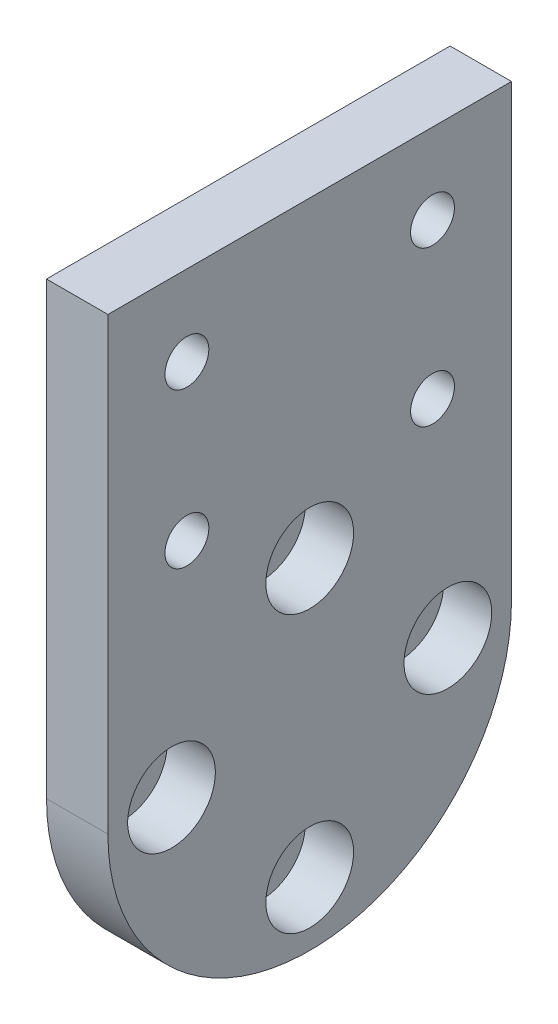
ISO-10303-21;
HEADER;
FILE_DESCRIPTION(('STEP AP214'),'2;1');
FILE_NAME('part.step','',(''),(''),'','','');
FILE_SCHEMA(('AUTOMOTIVE_DESIGN { 1 0 10303 214 1 1 1 1 }'));
ENDSEC;
DATA;
#1=APPLICATION_CONTEXT('core data for automotive mechanical design processes');
#2=APPLICATION_PROTOCOL_DEFINITION('international standard','automotive_design',2000,#1);
#3=PRODUCT_CONTEXT('',#1,'mechanical');
#4=PRODUCT('Part','Part','',(#3));
#5=PRODUCT_RELATED_PRODUCT_CATEGORY('part','',(#4));
#6=PRODUCT_DEFINITION_FORMATION('','',#4);
#7=PRODUCT_DEFINITION_CONTEXT('part definition',#1,'design');
#8=PRODUCT_DEFINITION('design','',#6,#7);
#9=PRODUCT_DEFINITION_SHAPE('','',#8);
#10=(LENGTH_UNIT() NAMED_UNIT(*) SI_UNIT(.MILLI.,.METRE.));
#11=(NAMED_UNIT(*) PLANE_ANGLE_UNIT() SI_UNIT($,.RADIAN.));
#12=(NAMED_UNIT(*) SI_UNIT($,.STERADIAN.) SOLID_ANGLE_UNIT());
#13=UNCERTAINTY_MEASURE_WITH_UNIT(LENGTH_MEASURE(1.E-05),#10,'distance_accuracy_value','');
#14=(GEOMETRIC_REPRESENTATION_CONTEXT(3) GLOBAL_UNCERTAINTY_ASSIGNED_CONTEXT((#13)) GLOBAL_UNIT_ASSIGNED_CONTEXT((#10,
#11,#12)) REPRESENTATION_CONTEXT('',''));
#15=CARTESIAN_POINT('',(0.,0.,0.));
#16=DIRECTION('',(0.,0.,1.));
#17=DIRECTION('',(1.,0.,0.));
#18=AXIS2_PLACEMENT_3D('',#15,#16,#17);
#19=CARTESIAN_POINT('',(-32.,-17.5,23.));
#20=DIRECTION('',(0.,0.,1.));
#21=DIRECTION('',(1.,0.,0.));
#22=AXIS2_PLACEMENT_3D('',#19,#20,#21);
#23=PLANE('',#22);
#24=DIRECTION('',(0.,-1.,0.));
#25=VECTOR('',#24,1.);
#26=CARTESIAN_POINT('',(-25.,-17.5,23.));
#27=LINE('',#26,#25);
#28=CARTESIAN_POINT('',(-25.,5.,23.));
#29=VERTEX_POINT('',#28);
#30=CARTESIAN_POINT('',(-25.,-46.302,23.));
#31=VERTEX_POINT('',#30);
#32=EDGE_CURVE('E118',#29,#31,#27,.T.);
#33=ORIENTED_EDGE('',*,*,#32,.F.);
#34=DIRECTION('',(1.,0.,0.));
#35=VECTOR('',#34,1.);
#36=CARTESIAN_POINT('',(-32.,5.,23.));
#37=LINE('',#36,#35);
#38=CARTESIAN_POINT('',(-32.,5.,23.));
#39=VERTEX_POINT('',#38);
#40=EDGE_CURVE('E11',#39,#29,#37,.T.);
#41=ORIENTED_EDGE('',*,*,#40,.F.);
#42=DIRECTION('',(0.,-1.,0.));
#43=VECTOR('',#42,1.);
#44=CARTESIAN_POINT('',(-32.,-17.5,23.));
#45=LINE('',#44,#43);
#46=CARTESIAN_POINT('',(-32.,-46.302,23.));
#47=VERTEX_POINT('',#46);
#48=EDGE_CURVE('E81',#39,#47,#45,.T.);
#49=ORIENTED_EDGE('',*,*,#48,.T.);
#50=DIRECTION('',(1.,0.,0.));
#51=VECTOR('',#50,1.);
#52=CARTESIAN_POINT('',(-32.,-46.302,23.));
#53=LINE('',#52,#51);
#54=EDGE_CURVE('E59',#47,#31,#53,.T.);
#55=ORIENTED_EDGE('',*,*,#54,.T.);
#56=EDGE_LOOP('',(#33,#41,#49,#55));
#57=FACE_BOUND('',#56,.T.);
#58=ADVANCED_FACE('F17',(#57),#23,.T.);
#59=CARTESIAN_POINT('',(-32.,5.,0.));
#60=DIRECTION('',(0.,-1.,0.));
#61=DIRECTION('',(0.,0.,-1.));
#62=AXIS2_PLACEMENT_3D('',#59,#60,#61);
#63=PLANE('',#62);
#64=DIRECTION('',(0.,0.,-1.));
#65=VECTOR('',#64,1.);
#66=CARTESIAN_POINT('',(-25.,5.,0.));
#67=LINE('',#66,#65);
#68=CARTESIAN_POINT('',(-25.,5.,-23.));
#69=VERTEX_POINT('',#68);
#70=EDGE_CURVE('E87',#29,#69,#67,.T.);
#71=ORIENTED_EDGE('',*,*,#70,.T.);
#72=DIRECTION('',(1.,0.,0.));
#73=VECTOR('',#72,1.);
#74=CARTESIAN_POINT('',(-32.,5.,-23.));
#75=LINE('',#74,#73);
#76=CARTESIAN_POINT('',(-32.,5.,-23.));
#77=VERTEX_POINT('',#76);
#78=EDGE_CURVE('E26',#77,#69,#75,.T.);
#79=ORIENTED_EDGE('',*,*,#78,.F.);
#80=DIRECTION('',(0.,0.,-1.));
#81=VECTOR('',#80,1.);
#82=CARTESIAN_POINT('',(-32.,5.,0.));
#83=LINE('',#82,#81);
#84=EDGE_CURVE('E77',#39,#77,#83,.T.);
#85=ORIENTED_EDGE('',*,*,#84,.F.);
#86=ORIENTED_EDGE('',*,*,#40,.T.);
#87=EDGE_LOOP('',(#71,#79,#85,#86));
#88=FACE_BOUND('',#87,.T.);
#89=ADVANCED_FACE('F85',(#88),#63,.F.);
#90=CARTESIAN_POINT('',(-32.,-20.651,-23.));
#91=DIRECTION('',(0.,0.,1.));
#92=DIRECTION('',(1.,0.,0.));
#93=AXIS2_PLACEMENT_3D('',#90,#91,#92);
#94=PLANE('',#93);
#95=DIRECTION('',(0.,-1.,0.));
#96=VECTOR('',#95,1.);
#97=CARTESIAN_POINT('',(-25.,-20.651,-23.));
#98=LINE('',#97,#96);
#99=CARTESIAN_POINT('',(-25.,-46.302,-23.));
#100=VERTEX_POINT('',#99);
#101=EDGE_CURVE('E68',#69,#100,#98,.T.);
#102=ORIENTED_EDGE('',*,*,#101,.T.);
#103=DIRECTION('',(1.,0.,0.));
#104=VECTOR('',#103,1.);
#105=CARTESIAN_POINT('',(-32.,-46.302,-23.));
#106=LINE('',#105,#104);
#107=CARTESIAN_POINT('',(-32.,-46.302,-23.));
#108=VERTEX_POINT('',#107);
#109=EDGE_CURVE('E89',#108,#100,#106,.T.);
#110=ORIENTED_EDGE('',*,*,#109,.F.);
#111=DIRECTION('',(0.,-1.,0.));
#112=VECTOR('',#111,1.);
#113=CARTESIAN_POINT('',(-32.,-20.651,-23.));
#114=LINE('',#113,#112);
#115=EDGE_CURVE('E39',#77,#108,#114,.T.);
#116=ORIENTED_EDGE('',*,*,#115,.F.);
#117=ORIENTED_EDGE('',*,*,#78,.T.);
#118=EDGE_LOOP('',(#102,#110,#116,#117));
#119=FACE_BOUND('',#118,.T.);
#120=ADVANCED_FACE('F90',(#119),#94,.F.);
#121=CARTESIAN_POINT('',(-32.,-4.17737907709263,-14.));
#122=DIRECTION('',(1.,0.,0.));
#123=DIRECTION('',(0.,0.,-1.));
#124=AXIS2_PLACEMENT_3D('',#121,#122,#123);
#125=CYLINDRICAL_SURFACE('',#124,2.5);
#126=CARTESIAN_POINT('',(-32.,-4.17737907709263,-14.));
#127=DIRECTION('',(-1.,0.,0.));
#128=DIRECTION('',(0.,0.,1.));
#129=AXIS2_PLACEMENT_3D('',#126,#127,#128);
#130=CIRCLE('',#129,2.5);
#131=CARTESIAN_POINT('',(-32.,-4.17737907709263,-11.5));
#132=VERTEX_POINT('',#131);
#133=EDGE_CURVE('E110',#132,#132,#130,.T.);
#134=ORIENTED_EDGE('',*,*,#133,.T.);
#135=EDGE_LOOP('',(#134));
#136=FACE_BOUND('',#135,.T.);
#137=CARTESIAN_POINT('',(-25.,-4.17737907709263,-14.));
#138=DIRECTION('',(-1.,0.,0.));
#139=DIRECTION('',(0.,0.,1.));
#140=AXIS2_PLACEMENT_3D('',#137,#138,#139);
#141=CIRCLE('',#140,2.5);
#142=CARTESIAN_POINT('',(-25.,-4.17737907709263,-11.5));
#143=VERTEX_POINT('',#142);
#144=EDGE_CURVE('E136',#143,#143,#141,.T.);
#145=ORIENTED_EDGE('',*,*,#144,.F.);
#146=EDGE_LOOP('',(#145));
#147=FACE_BOUND('',#146,.T.);
#148=ADVANCED_FACE('F279',(#136,#147),#125,.F.);
#149=CARTESIAN_POINT('',(-32.,-4.17737907709263,14.));
#150=DIRECTION('',(1.,0.,0.));
#151=DIRECTION('',(0.,0.,-1.));
#152=AXIS2_PLACEMENT_3D('',#149,#150,#151);
#153=CYLINDRICAL_SURFACE('',#152,2.5);
#154=CARTESIAN_POINT('',(-32.,-4.17737907709263,14.));
#155=DIRECTION('',(1.,0.,0.));
#156=DIRECTION('',(0.,0.,1.));
#157=AXIS2_PLACEMENT_3D('',#154,#155,#156);
#158=CIRCLE('',#157,2.5);
#159=CARTESIAN_POINT('',(-32.,-4.17737907709263,16.5));
#160=VERTEX_POINT('',#159);
#161=EDGE_CURVE('E106',#160,#160,#158,.T.);
#162=ORIENTED_EDGE('',*,*,#161,.F.);
#163=EDGE_LOOP('',(#162));
#164=FACE_BOUND('',#163,.T.);
#165=CARTESIAN_POINT('',(-25.,-4.17737907709263,14.));
#166=DIRECTION('',(1.,0.,0.));
#167=DIRECTION('',(0.,0.,1.));
#168=AXIS2_PLACEMENT_3D('',#165,#166,#167);
#169=CIRCLE('',#168,2.5);
#170=CARTESIAN_POINT('',(-25.,-4.17737907709263,16.5));
#171=VERTEX_POINT('',#170);
#172=EDGE_CURVE('E132',#171,#171,#169,.T.);
#173=ORIENTED_EDGE('',*,*,#172,.T.);
#174=EDGE_LOOP('',(#173));
#175=FACE_BOUND('',#174,.T.);
#176=ADVANCED_FACE('F284',(#164,#175),#153,.F.);
#177=CARTESIAN_POINT('',(-32.,-21.8226209229073,14.));
#178=DIRECTION('',(1.,0.,0.));
#179=DIRECTION('',(0.,0.,-1.));
#180=AXIS2_PLACEMENT_3D('',#177,#178,#179);
#181=CYLINDRICAL_SURFACE('',#180,2.5);
#182=CARTESIAN_POINT('',(-32.,-21.8226209229073,14.));
#183=DIRECTION('',(-1.,0.,0.));
#184=DIRECTION('',(0.,0.,1.));
#185=AXIS2_PLACEMENT_3D('',#182,#183,#184);
#186=CIRCLE('',#185,2.5);
#187=CARTESIAN_POINT('',(-32.,-21.8226209229073,16.5));
#188=VERTEX_POINT('',#187);
#189=EDGE_CURVE('E99',#188,#188,#186,.T.);
#190=ORIENTED_EDGE('',*,*,#189,.T.);
#191=EDGE_LOOP('',(#190));
#192=FACE_BOUND('',#191,.T.);
#193=CARTESIAN_POINT('',(-25.,-21.8226209229073,14.));
#194=DIRECTION('',(-1.,0.,0.));
#195=DIRECTION('',(0.,0.,1.));
#196=AXIS2_PLACEMENT_3D('',#193,#194,#195);
#197=CIRCLE('',#196,2.5);
#198=CARTESIAN_POINT('',(-25.,-21.8226209229073,16.5));
#199=VERTEX_POINT('',#198);
#200=EDGE_CURVE('E128',#199,#199,#197,.T.);
#201=ORIENTED_EDGE('',*,*,#200,.F.);
#202=EDGE_LOOP('',(#201));
#203=FACE_BOUND('',#202,.T.);
#204=ADVANCED_FACE('F267',(#192,#203),#181,.F.);
#205=CARTESIAN_POINT('',(-32.,-46.302,0.));
#206=DIRECTION('',(1.,0.,0.));
#207=DIRECTION('',(0.,0.,-1.));
#208=AXIS2_PLACEMENT_3D('',#205,#206,#207);
#209=CYLINDRICAL_SURFACE('',#208,23.);
#210=CARTESIAN_POINT('',(-25.,-46.302,0.));
#211=DIRECTION('',(-1.,0.,0.));
#212=DIRECTION('',(0.,0.,1.));
#213=AXIS2_PLACEMENT_3D('',#210,#211,#212);
#214=CIRCLE('',#213,23.);
#215=EDGE_CURVE('E125',#100,#31,#214,.T.);
#216=ORIENTED_EDGE('',*,*,#215,.T.);
#217=ORIENTED_EDGE('',*,*,#54,.F.);
#218=CARTESIAN_POINT('',(-32.,-46.302,0.));
#219=DIRECTION('',(-1.,0.,0.));
#220=DIRECTION('',(0.,0.,1.));
#221=AXIS2_PLACEMENT_3D('',#218,#219,#220);
#222=CIRCLE('',#221,23.);
#223=EDGE_CURVE('E93',#108,#47,#222,.T.);
#224=ORIENTED_EDGE('',*,*,#223,.F.);
#225=ORIENTED_EDGE('',*,*,#109,.T.);
#226=EDGE_LOOP('',(#216,#217,#224,#225));
#227=FACE_BOUND('',#226,.T.);
#228=ADVANCED_FACE('F257',(#227),#209,.T.);
#229=CARTESIAN_POINT('',(-32.,-21.8226209229073,-14.));
#230=DIRECTION('',(1.,0.,0.));
#231=DIRECTION('',(0.,0.,-1.));
#232=AXIS2_PLACEMENT_3D('',#229,#230,#231);
#233=CYLINDRICAL_SURFACE('',#232,2.5);
#234=CARTESIAN_POINT('',(-32.,-21.8226209229073,-14.));
#235=DIRECTION('',(1.,0.,0.));
#236=DIRECTION('',(0.,0.,1.));
#237=AXIS2_PLACEMENT_3D('',#234,#235,#236);
#238=CIRCLE('',#237,2.5);
#239=CARTESIAN_POINT('',(-32.,-21.8226209229073,-11.5));
#240=VERTEX_POINT('',#239);
#241=EDGE_CURVE('E114',#240,#240,#238,.T.);
#242=ORIENTED_EDGE('',*,*,#241,.F.);
#243=EDGE_LOOP('',(#242));
#244=FACE_BOUND('',#243,.T.);
#245=CARTESIAN_POINT('',(-25.,-21.8226209229073,-14.));
#246=DIRECTION('',(1.,0.,0.));
#247=DIRECTION('',(0.,0.,1.));
#248=AXIS2_PLACEMENT_3D('',#245,#246,#247);
#249=CIRCLE('',#248,2.5);
#250=CARTESIAN_POINT('',(-25.,-21.8226209229073,-11.5));
#251=VERTEX_POINT('',#250);
#252=EDGE_CURVE('E140',#251,#251,#249,.T.);
#253=ORIENTED_EDGE('',*,*,#252,.T.);
#254=EDGE_LOOP('',(#253));
#255=FACE_BOUND('',#254,.T.);
#256=ADVANCED_FACE('F255',(#244,#255),#233,.F.);
#257=CARTESIAN_POINT('',(-32.,-32.151,0.));
#258=DIRECTION('',(-1.,0.,0.));
#259=DIRECTION('',(0.,-1.,0.));
#260=AXIS2_PLACEMENT_3D('',#257,#258,#259);
#261=PLANE('',#260);
#262=CARTESIAN_POINT('',(-32.,-62.052,0.));
#263=DIRECTION('',(-1.,0.,0.));
#264=DIRECTION('',(0.,0.,1.));
#265=AXIS2_PLACEMENT_3D('',#262,#263,#264);
#266=CIRCLE('',#265,2.7);
#267=CARTESIAN_POINT('',(-32.,-62.052,2.69999999999998));
#268=VERTEX_POINT('',#267);
#269=EDGE_CURVE('E191',#268,#268,#266,.T.);
#270=ORIENTED_EDGE('',*,*,#269,.F.);
#271=EDGE_LOOP('',(#270));
#272=FACE_BOUND('',#271,.T.);
#273=CARTESIAN_POINT('',(-32.,-46.302,-15.75));
#274=DIRECTION('',(-1.,0.,0.));
#275=DIRECTION('',(0.,0.,1.));
#276=AXIS2_PLACEMENT_3D('',#273,#274,#275);
#277=CIRCLE('',#276,2.7);
#278=CARTESIAN_POINT('',(-32.,-46.302,-13.05));
#279=VERTEX_POINT('',#278);
#280=EDGE_CURVE('E161',#279,#279,#277,.T.);
#281=ORIENTED_EDGE('',*,*,#280,.F.);
#282=EDGE_LOOP('',(#281));
#283=FACE_BOUND('',#282,.T.);
#284=CARTESIAN_POINT('',(-32.,-30.552,0.));
#285=DIRECTION('',(-1.,0.,0.));
#286=DIRECTION('',(0.,0.,1.));
#287=AXIS2_PLACEMENT_3D('',#284,#285,#286);
#288=CIRCLE('',#287,2.7);
#289=CARTESIAN_POINT('',(-32.,-30.552,2.70000000000001));
#290=VERTEX_POINT('',#289);
#291=EDGE_CURVE('E195',#290,#290,#288,.T.);
#292=ORIENTED_EDGE('',*,*,#291,.F.);
#293=EDGE_LOOP('',(#292));
#294=FACE_BOUND('',#293,.T.);
#295=CARTESIAN_POINT('',(-32.,-46.302,15.75));
#296=DIRECTION('',(-1.,0.,0.));
#297=DIRECTION('',(0.,0.,1.));
#298=AXIS2_PLACEMENT_3D('',#295,#296,#297);
#299=CIRCLE('',#298,2.7);
#300=CARTESIAN_POINT('',(-32.,-46.302,18.45));
#301=VERTEX_POINT('',#300);
#302=EDGE_CURVE('E199',#301,#301,#299,.T.);
#303=ORIENTED_EDGE('',*,*,#302,.F.);
#304=EDGE_LOOP('',(#303));
#305=FACE_BOUND('',#304,.T.);
#306=ORIENTED_EDGE('',*,*,#48,.F.);
#307=ORIENTED_EDGE('',*,*,#84,.T.);
#308=ORIENTED_EDGE('',*,*,#115,.T.);
#309=ORIENTED_EDGE('',*,*,#223,.T.);
#310=EDGE_LOOP('',(#306,#307,#308,#309));
#311=FACE_BOUND('',#310,.T.);
#312=ORIENTED_EDGE('',*,*,#189,.F.);
#313=EDGE_LOOP('',(#312));
#314=FACE_BOUND('',#313,.T.);
#315=ORIENTED_EDGE('',*,*,#161,.T.);
#316=EDGE_LOOP('',(#315));
#317=FACE_BOUND('',#316,.T.);
#318=ORIENTED_EDGE('',*,*,#133,.F.);
#319=EDGE_LOOP('',(#318));
#320=FACE_BOUND('',#319,.T.);
#321=ORIENTED_EDGE('',*,*,#241,.T.);
#322=EDGE_LOOP('',(#321));
#323=FACE_BOUND('',#322,.T.);
#324=ADVANCED_FACE('F79',(#272,#283,#294,#305,#311,#314,#317,#320,#323),#261,.T.);
#325=CARTESIAN_POINT('',(-25.,-32.151,0.));
#326=DIRECTION('',(-1.,0.,0.));
#327=DIRECTION('',(0.,-1.,0.));
#328=AXIS2_PLACEMENT_3D('',#325,#326,#327);
#329=PLANE('',#328);
#330=CARTESIAN_POINT('',(-25.,-46.302,15.75));
#331=DIRECTION('',(1.,0.,0.));
#332=DIRECTION('',(0.,0.,-1.));
#333=AXIS2_PLACEMENT_3D('',#330,#331,#332);
#334=CIRCLE('',#333,5.);
#335=CARTESIAN_POINT('',(-25.,-46.302,10.75));
#336=VERTEX_POINT('',#335);
#337=EDGE_CURVE('E181',#336,#336,#334,.T.);
#338=ORIENTED_EDGE('',*,*,#337,.F.);
#339=EDGE_LOOP('',(#338));
#340=FACE_BOUND('',#339,.T.);
#341=CARTESIAN_POINT('',(-25.,-30.552,0.));
#342=DIRECTION('',(1.,0.,0.));
#343=DIRECTION('',(0.,0.,-1.));
#344=AXIS2_PLACEMENT_3D('',#341,#342,#343);
#345=CIRCLE('',#344,5.);
#346=CARTESIAN_POINT('',(-25.,-30.552,-5.));
#347=VERTEX_POINT('',#346);
#348=EDGE_CURVE('E173',#347,#347,#345,.T.);
#349=ORIENTED_EDGE('',*,*,#348,.F.);
#350=EDGE_LOOP('',(#349));
#351=FACE_BOUND('',#350,.T.);
#352=CARTESIAN_POINT('',(-25.,-62.052,0.));
#353=DIRECTION('',(1.,0.,0.));
#354=DIRECTION('',(0.,0.,-1.));
#355=AXIS2_PLACEMENT_3D('',#352,#353,#354);
#356=CIRCLE('',#355,5.);
#357=CARTESIAN_POINT('',(-25.,-62.052,-5.));
#358=VERTEX_POINT('',#357);
#359=EDGE_CURVE('E165',#358,#358,#356,.T.);
#360=ORIENTED_EDGE('',*,*,#359,.F.);
#361=EDGE_LOOP('',(#360));
#362=FACE_BOUND('',#361,.T.);
#363=CARTESIAN_POINT('',(-25.,-46.302,-15.75));
#364=DIRECTION('',(1.,0.,0.));
#365=DIRECTION('',(0.,0.,-1.));
#366=AXIS2_PLACEMENT_3D('',#363,#364,#365);
#367=CIRCLE('',#366,5.);
#368=CARTESIAN_POINT('',(-25.,-46.302,-20.75));
#369=VERTEX_POINT('',#368);
#370=EDGE_CURVE('E156',#369,#369,#367,.T.);
#371=ORIENTED_EDGE('',*,*,#370,.F.);
#372=EDGE_LOOP('',(#371));
#373=FACE_BOUND('',#372,.T.);
#374=ORIENTED_EDGE('',*,*,#32,.T.);
#375=ORIENTED_EDGE('',*,*,#215,.F.);
#376=ORIENTED_EDGE('',*,*,#101,.F.);
#377=ORIENTED_EDGE('',*,*,#70,.F.);
#378=EDGE_LOOP('',(#374,#375,#376,#377));
#379=FACE_BOUND('',#378,.T.);
#380=ORIENTED_EDGE('',*,*,#200,.T.);
#381=EDGE_LOOP('',(#380));
#382=FACE_BOUND('',#381,.T.);
#383=ORIENTED_EDGE('',*,*,#172,.F.);
#384=EDGE_LOOP('',(#383));
#385=FACE_BOUND('',#384,.T.);
#386=ORIENTED_EDGE('',*,*,#144,.T.);
#387=EDGE_LOOP('',(#386));
#388=FACE_BOUND('',#387,.T.);
#389=ORIENTED_EDGE('',*,*,#252,.F.);
#390=EDGE_LOOP('',(#389));
#391=FACE_BOUND('',#390,.T.);
#392=ADVANCED_FACE('F237',(#340,#351,#362,#373,#379,#382,#385,#388,#391),#329,.F.);
#393=CARTESIAN_POINT('',(-30.5,-46.302,-15.75));
#394=DIRECTION('',(1.,0.,0.));
#395=DIRECTION('',(0.,0.,-1.));
#396=AXIS2_PLACEMENT_3D('',#393,#394,#395);
#397=CYLINDRICAL_SURFACE('',#396,5.);
#398=CARTESIAN_POINT('',(-30.5,-46.302,-15.75));
#399=DIRECTION('',(1.,0.,0.));
#400=DIRECTION('',(0.,0.,-1.));
#401=AXIS2_PLACEMENT_3D('',#398,#399,#400);
#402=CIRCLE('',#401,5.);
#403=CARTESIAN_POINT('',(-30.5,-46.302,-20.75));
#404=VERTEX_POINT('',#403);
#405=EDGE_CURVE('E160',#404,#404,#402,.T.);
#406=ORIENTED_EDGE('',*,*,#405,.F.);
#407=EDGE_LOOP('',(#406));
#408=FACE_BOUND('',#407,.T.);
#409=ORIENTED_EDGE('',*,*,#370,.T.);
#410=EDGE_LOOP('',(#409));
#411=FACE_BOUND('',#410,.T.);
#412=ADVANCED_FACE('F240',(#408,#411),#397,.F.);
#413=CARTESIAN_POINT('',(-30.5,-32.151,0.));
#414=DIRECTION('',(1.,0.,0.));
#415=DIRECTION('',(0.,1.,0.));
#416=AXIS2_PLACEMENT_3D('',#413,#414,#415);
#417=PLANE('',#416);
#418=CARTESIAN_POINT('',(-30.5,-46.302,-15.75));
#419=DIRECTION('',(1.,0.,0.));
#420=DIRECTION('',(0.,0.,-1.));
#421=AXIS2_PLACEMENT_3D('',#418,#419,#420);
#422=CIRCLE('',#421,2.7);
#423=CARTESIAN_POINT('',(-30.5,-46.302,-18.45));
#424=VERTEX_POINT('',#423);
#425=EDGE_CURVE('E212',#424,#424,#422,.T.);
#426=ORIENTED_EDGE('',*,*,#425,.F.);
#427=EDGE_LOOP('',(#426));
#428=FACE_BOUND('',#427,.T.);
#429=ORIENTED_EDGE('',*,*,#405,.T.);
#430=EDGE_LOOP('',(#429));
#431=FACE_BOUND('',#430,.T.);
#432=ADVANCED_FACE('F233',(#428,#431),#417,.T.);
#433=CARTESIAN_POINT('',(-30.5,-62.052,0.));
#434=DIRECTION('',(1.,0.,0.));
#435=DIRECTION('',(0.,0.,-1.));
#436=AXIS2_PLACEMENT_3D('',#433,#434,#435);
#437=CYLINDRICAL_SURFACE('',#436,5.);
#438=CARTESIAN_POINT('',(-30.5,-62.052,0.));
#439=DIRECTION('',(1.,0.,0.));
#440=DIRECTION('',(0.,0.,-1.));
#441=AXIS2_PLACEMENT_3D('',#438,#439,#440);
#442=CIRCLE('',#441,5.);
#443=CARTESIAN_POINT('',(-30.5,-62.052,-5.));
#444=VERTEX_POINT('',#443);
#445=EDGE_CURVE('E169',#444,#444,#442,.T.);
#446=ORIENTED_EDGE('',*,*,#445,.F.);
#447=EDGE_LOOP('',(#446));
#448=FACE_BOUND('',#447,.T.);
#449=ORIENTED_EDGE('',*,*,#359,.T.);
#450=EDGE_LOOP('',(#449));
#451=FACE_BOUND('',#450,.T.);
#452=ADVANCED_FACE('F227',(#448,#451),#437,.F.);
#453=CARTESIAN_POINT('',(-30.5,-32.151,0.));
#454=DIRECTION('',(1.,0.,0.));
#455=DIRECTION('',(0.,1.,0.));
#456=AXIS2_PLACEMENT_3D('',#453,#454,#455);
#457=PLANE('',#456);
#458=CARTESIAN_POINT('',(-30.5,-62.052,0.));
#459=DIRECTION('',(1.,0.,0.));
#460=DIRECTION('',(0.,0.,-1.));
#461=AXIS2_PLACEMENT_3D('',#458,#459,#460);
#462=CIRCLE('',#461,2.7);
#463=CARTESIAN_POINT('',(-30.5,-62.052,-2.70000000000002));
#464=VERTEX_POINT('',#463);
#465=EDGE_CURVE('E203',#464,#464,#462,.T.);
#466=ORIENTED_EDGE('',*,*,#465,.F.);
#467=EDGE_LOOP('',(#466));
#468=FACE_BOUND('',#467,.T.);
#469=ORIENTED_EDGE('',*,*,#445,.T.);
#470=EDGE_LOOP('',(#469));
#471=FACE_BOUND('',#470,.T.);
#472=ADVANCED_FACE('F223',(#468,#471),#457,.T.);
#473=CARTESIAN_POINT('',(-30.5,-30.552,0.));
#474=DIRECTION('',(1.,0.,0.));
#475=DIRECTION('',(0.,0.,-1.));
#476=AXIS2_PLACEMENT_3D('',#473,#474,#475);
#477=CYLINDRICAL_SURFACE('',#476,5.);
#478=CARTESIAN_POINT('',(-30.5,-30.552,0.));
#479=DIRECTION('',(1.,0.,0.));
#480=DIRECTION('',(0.,0.,-1.));
#481=AXIS2_PLACEMENT_3D('',#478,#479,#480);
#482=CIRCLE('',#481,5.);
#483=CARTESIAN_POINT('',(-30.5,-30.552,-5.));
#484=VERTEX_POINT('',#483);
#485=EDGE_CURVE('E177',#484,#484,#482,.T.);
#486=ORIENTED_EDGE('',*,*,#485,.F.);
#487=EDGE_LOOP('',(#486));
#488=FACE_BOUND('',#487,.T.);
#489=ORIENTED_EDGE('',*,*,#348,.T.);
#490=EDGE_LOOP('',(#489));
#491=FACE_BOUND('',#490,.T.);
#492=ADVANCED_FACE('F226',(#488,#491),#477,.F.);
#493=CARTESIAN_POINT('',(-30.5,-32.151,0.));
#494=DIRECTION('',(1.,0.,0.));
#495=DIRECTION('',(0.,1.,0.));
#496=AXIS2_PLACEMENT_3D('',#493,#494,#495);
#497=PLANE('',#496);
#498=CARTESIAN_POINT('',(-30.5,-30.552,0.));
#499=DIRECTION('',(1.,0.,0.));
#500=DIRECTION('',(0.,0.,-1.));
#501=AXIS2_PLACEMENT_3D('',#498,#499,#500);
#502=CIRCLE('',#501,2.7);
#503=CARTESIAN_POINT('',(-30.5,-30.552,-2.7));
#504=VERTEX_POINT('',#503);
#505=EDGE_CURVE('E208',#504,#504,#502,.T.);
#506=ORIENTED_EDGE('',*,*,#505,.F.);
#507=EDGE_LOOP('',(#506));
#508=FACE_BOUND('',#507,.T.);
#509=ORIENTED_EDGE('',*,*,#485,.T.);
#510=EDGE_LOOP('',(#509));
#511=FACE_BOUND('',#510,.T.);
#512=ADVANCED_FACE('F378',(#508,#511),#497,.T.);
#513=CARTESIAN_POINT('',(-30.5,-46.302,15.75));
#514=DIRECTION('',(1.,0.,0.));
#515=DIRECTION('',(0.,0.,-1.));
#516=AXIS2_PLACEMENT_3D('',#513,#514,#515);
#517=CYLINDRICAL_SURFACE('',#516,5.);
#518=CARTESIAN_POINT('',(-30.5,-46.302,15.75));
#519=DIRECTION('',(1.,0.,0.));
#520=DIRECTION('',(0.,0.,-1.));
#521=AXIS2_PLACEMENT_3D('',#518,#519,#520);
#522=CIRCLE('',#521,5.);
#523=CARTESIAN_POINT('',(-30.5,-46.302,10.75));
#524=VERTEX_POINT('',#523);
#525=EDGE_CURVE('E122',#524,#524,#522,.T.);
#526=ORIENTED_EDGE('',*,*,#525,.F.);
#527=EDGE_LOOP('',(#526));
#528=FACE_BOUND('',#527,.T.);
#529=ORIENTED_EDGE('',*,*,#337,.T.);
#530=EDGE_LOOP('',(#529));
#531=FACE_BOUND('',#530,.T.);
#532=ADVANCED_FACE('F389',(#528,#531),#517,.F.);
#533=CARTESIAN_POINT('',(-30.5,-32.151,0.));
#534=DIRECTION('',(1.,0.,0.));
#535=DIRECTION('',(0.,1.,0.));
#536=AXIS2_PLACEMENT_3D('',#533,#534,#535);
#537=PLANE('',#536);
#538=CARTESIAN_POINT('',(-30.5,-46.302,15.75));
#539=DIRECTION('',(1.,0.,0.));
#540=DIRECTION('',(0.,0.,-1.));
#541=AXIS2_PLACEMENT_3D('',#538,#539,#540);
#542=CIRCLE('',#541,2.7);
#543=CARTESIAN_POINT('',(-30.5,-46.302,13.05));
#544=VERTEX_POINT('',#543);
#545=EDGE_CURVE('E204',#544,#544,#542,.T.);
#546=ORIENTED_EDGE('',*,*,#545,.F.);
#547=EDGE_LOOP('',(#546));
#548=FACE_BOUND('',#547,.T.);
#549=ORIENTED_EDGE('',*,*,#525,.T.);
#550=EDGE_LOOP('',(#549));
#551=FACE_BOUND('',#550,.T.);
#552=ADVANCED_FACE('F400',(#548,#551),#537,.T.);
#553=CARTESIAN_POINT('',(-193.34975928501,-46.302,15.75));
#554=DIRECTION('',(1.,0.,0.));
#555=DIRECTION('',(0.,0.,-1.));
#556=AXIS2_PLACEMENT_3D('',#553,#554,#555);
#557=CYLINDRICAL_SURFACE('',#556,2.7);
#558=ORIENTED_EDGE('',*,*,#302,.T.);
#559=EDGE_LOOP('',(#558));
#560=FACE_BOUND('',#559,.T.);
#561=ORIENTED_EDGE('',*,*,#545,.T.);
#562=EDGE_LOOP('',(#561));
#563=FACE_BOUND('',#562,.T.);
#564=ADVANCED_FACE('F411',(#560,#563),#557,.F.);
#565=CARTESIAN_POINT('',(-193.34975928501,-30.552,0.));
#566=DIRECTION('',(1.,0.,0.));
#567=DIRECTION('',(0.,0.,-1.));
#568=AXIS2_PLACEMENT_3D('',#565,#566,#567);
#569=CYLINDRICAL_SURFACE('',#568,2.7);
#570=ORIENTED_EDGE('',*,*,#291,.T.);
#571=EDGE_LOOP('',(#570));
#572=FACE_BOUND('',#571,.T.);
#573=ORIENTED_EDGE('',*,*,#505,.T.);
#574=EDGE_LOOP('',(#573));
#575=FACE_BOUND('',#574,.T.);
#576=ADVANCED_FACE('F422',(#572,#575),#569,.F.);
#577=CARTESIAN_POINT('',(-193.34975928501,-62.052,0.));
#578=DIRECTION('',(1.,0.,0.));
#579=DIRECTION('',(0.,0.,-1.));
#580=AXIS2_PLACEMENT_3D('',#577,#578,#579);
#581=CYLINDRICAL_SURFACE('',#580,2.7);
#582=ORIENTED_EDGE('',*,*,#269,.T.);
#583=EDGE_LOOP('',(#582));
#584=FACE_BOUND('',#583,.T.);
#585=ORIENTED_EDGE('',*,*,#465,.T.);
#586=EDGE_LOOP('',(#585));
#587=FACE_BOUND('',#586,.T.);
#588=ADVANCED_FACE('F221',(#584,#587),#581,.F.);
#589=CARTESIAN_POINT('',(-193.34975928501,-46.302,-15.75));
#590=DIRECTION('',(1.,0.,0.));
#591=DIRECTION('',(0.,0.,-1.));
#592=AXIS2_PLACEMENT_3D('',#589,#590,#591);
#593=CYLINDRICAL_SURFACE('',#592,2.7);
#594=ORIENTED_EDGE('',*,*,#280,.T.);
#595=EDGE_LOOP('',(#594));
#596=FACE_BOUND('',#595,.T.);
#597=ORIENTED_EDGE('',*,*,#425,.T.);
#598=EDGE_LOOP('',(#597));
#599=FACE_BOUND('',#598,.T.);
#600=ADVANCED_FACE('F443',(#596,#599),#593,.F.);
#601=CLOSED_SHELL('',(#58,#89,#120,#148,#176,#204,#228,#256,#324,#392,#412,#432,#452,#472,#492,
#512,#532,#552,#564,#576,#588,#600));
#602=MANIFOLD_SOLID_BREP('B1',#601);
#603=ADVANCED_BREP_SHAPE_REPRESENTATION('',(#18,#602),#14);
#604=SHAPE_DEFINITION_REPRESENTATION(#9,#603);
ENDSEC;
END-ISO-10303-21;
